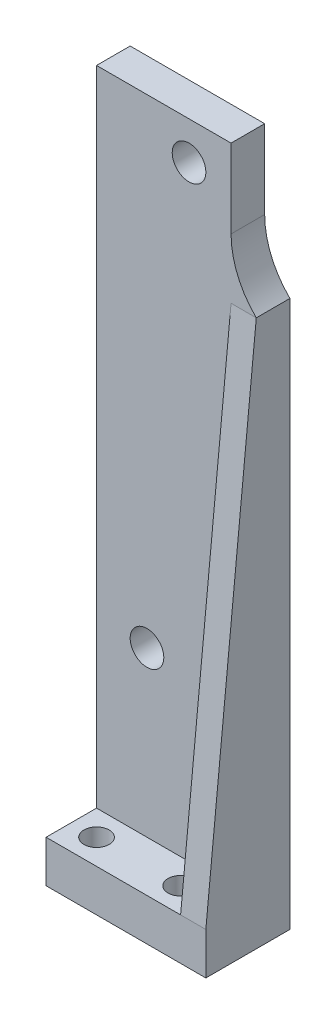
ISO-10303-21;
HEADER;
FILE_DESCRIPTION(('STEP AP214'),'2;1');
FILE_NAME('part.step','',(''),(''),'','','');
FILE_SCHEMA(('AUTOMOTIVE_DESIGN { 1 0 10303 214 1 1 1 1 }'));
ENDSEC;
DATA;
#1=APPLICATION_CONTEXT('core data for automotive mechanical design processes');
#2=APPLICATION_PROTOCOL_DEFINITION('international standard','automotive_design',2000,#1);
#3=PRODUCT_CONTEXT('',#1,'mechanical');
#4=PRODUCT('Part','Part','',(#3));
#5=PRODUCT_RELATED_PRODUCT_CATEGORY('part','',(#4));
#6=PRODUCT_DEFINITION_FORMATION('','',#4);
#7=PRODUCT_DEFINITION_CONTEXT('part definition',#1,'design');
#8=PRODUCT_DEFINITION('design','',#6,#7);
#9=PRODUCT_DEFINITION_SHAPE('','',#8);
#10=(LENGTH_UNIT() NAMED_UNIT(*) SI_UNIT(.MILLI.,.METRE.));
#11=(NAMED_UNIT(*) PLANE_ANGLE_UNIT() SI_UNIT($,.RADIAN.));
#12=(NAMED_UNIT(*) SI_UNIT($,.STERADIAN.) SOLID_ANGLE_UNIT());
#13=UNCERTAINTY_MEASURE_WITH_UNIT(LENGTH_MEASURE(1.E-05),#10,'distance_accuracy_value','');
#14=(GEOMETRIC_REPRESENTATION_CONTEXT(3) GLOBAL_UNCERTAINTY_ASSIGNED_CONTEXT((#13)) GLOBAL_UNIT_ASSIGNED_CONTEXT((#10,
#11,#12)) REPRESENTATION_CONTEXT('',''));
#15=CARTESIAN_POINT('',(0.,0.,0.));
#16=DIRECTION('',(0.,0.,1.));
#17=DIRECTION('',(1.,0.,0.));
#18=AXIS2_PLACEMENT_3D('',#15,#16,#17);
#19=CARTESIAN_POINT('',(1.00000000000001,77.,3.));
#20=DIRECTION('',(0.,0.,-1.));
#21=DIRECTION('',(-1.,0.,0.));
#22=AXIS2_PLACEMENT_3D('',#19,#20,#21);
#23=CYLINDRICAL_SURFACE('',#22,2.);
#24=CARTESIAN_POINT('',(1.00000000000001,77.,-3.));
#25=DIRECTION('',(0.,0.,1.));
#26=DIRECTION('',(1.,0.,0.));
#27=AXIS2_PLACEMENT_3D('',#24,#25,#26);
#28=CIRCLE('',#27,2.);
#29=CARTESIAN_POINT('',(3.00000000000001,77.,-3.));
#30=VERTEX_POINT('',#29);
#31=EDGE_CURVE('E242',#30,#30,#28,.T.);
#32=ORIENTED_EDGE('',*,*,#31,.T.);
#33=EDGE_LOOP('',(#32));
#34=FACE_BOUND('',#33,.T.);
#35=CARTESIAN_POINT('',(1.00000000000001,77.,-6.));
#36=DIRECTION('',(0.,0.,-1.));
#37=DIRECTION('',(-1.,0.,0.));
#38=AXIS2_PLACEMENT_3D('',#35,#36,#37);
#39=CIRCLE('',#38,2.);
#40=CARTESIAN_POINT('',(-0.999999999999993,77.,-6.));
#41=VERTEX_POINT('',#40);
#42=EDGE_CURVE('E163',#41,#41,#39,.F.);
#43=ORIENTED_EDGE('',*,*,#42,.F.);
#44=EDGE_LOOP('',(#43));
#45=FACE_BOUND('',#44,.T.);
#46=ADVANCED_FACE('F43',(#34,#45),#23,.F.);
#47=CARTESIAN_POINT('',(0.,5.,3.));
#48=DIRECTION('',(0.,0.,-1.));
#49=DIRECTION('',(-1.,0.,0.));
#50=AXIS2_PLACEMENT_3D('',#47,#48,#49);
#51=PLANE('',#50);
#52=DIRECTION('',(1.,0.,0.));
#53=VECTOR('',#52,1.);
#54=CARTESIAN_POINT('',(0.,0.,3.));
#55=LINE('',#54,#53);
#56=CARTESIAN_POINT('',(-10.,0.,3.));
#57=VERTEX_POINT('',#56);
#58=CARTESIAN_POINT('',(9.,0.,3.));
#59=VERTEX_POINT('',#58);
#60=EDGE_CURVE('E234',#57,#59,#55,.T.);
#61=ORIENTED_EDGE('',*,*,#60,.T.);
#62=DIRECTION('',(0.,-1.,0.));
#63=VECTOR('',#62,1.);
#64=CARTESIAN_POINT('',(9.,5.,3.));
#65=LINE('',#64,#63);
#66=CARTESIAN_POINT('',(9.,5.,3.));
#67=VERTEX_POINT('',#66);
#68=EDGE_CURVE('E135',#67,#59,#65,.T.);
#69=ORIENTED_EDGE('',*,*,#68,.F.);
#70=DIRECTION('',(-1.,0.,0.));
#71=VECTOR('',#70,1.);
#72=CARTESIAN_POINT('',(9.,5.,3.));
#73=LINE('',#72,#71);
#74=CARTESIAN_POINT('',(6.,5.,3.));
#75=VERTEX_POINT('',#74);
#76=EDGE_CURVE('E132',#67,#75,#73,.T.);
#77=ORIENTED_EDGE('',*,*,#76,.T.);
#78=DIRECTION('',(1.,0.,0.));
#79=VECTOR('',#78,1.);
#80=CARTESIAN_POINT('',(0.,5.,3.));
#81=LINE('',#80,#79);
#82=CARTESIAN_POINT('',(-10.,5.,3.));
#83=VERTEX_POINT('',#82);
#84=EDGE_CURVE('E213',#83,#75,#81,.T.);
#85=ORIENTED_EDGE('',*,*,#84,.F.);
#86=DIRECTION('',(0.,-1.,0.));
#87=VECTOR('',#86,1.);
#88=CARTESIAN_POINT('',(-10.,5.,3.));
#89=LINE('',#88,#87);
#90=EDGE_CURVE('E226',#83,#57,#89,.T.);
#91=ORIENTED_EDGE('',*,*,#90,.T.);
#92=EDGE_LOOP('',(#61,#69,#77,#85,#91));
#93=FACE_BOUND('',#92,.T.);
#94=ADVANCED_FACE('F278',(#93),#51,.F.);
#95=CARTESIAN_POINT('',(6.,5.,0.));
#96=DIRECTION('',(1.,0.,0.));
#97=DIRECTION('',(0.,0.,-1.));
#98=AXIS2_PLACEMENT_3D('',#95,#96,#97);
#99=PLANE('',#98);
#100=DIRECTION('',(0.,1.,0.));
#101=VECTOR('',#100,1.);
#102=CARTESIAN_POINT('',(6.,0.,-3.));
#103=LINE('',#102,#101);
#104=CARTESIAN_POINT('',(6.,72.1414284285429,-3.));
#105=VERTEX_POINT('',#104);
#106=CARTESIAN_POINT('',(6.,81.5,-3.));
#107=VERTEX_POINT('',#106);
#108=EDGE_CURVE('E191',#105,#107,#103,.T.);
#109=ORIENTED_EDGE('',*,*,#108,.F.);
#110=DIRECTION('',(0.,0.,-1.));
#111=VECTOR('',#110,1.);
#112=CARTESIAN_POINT('',(6.,72.1414284285429,-7.));
#113=LINE('',#112,#111);
#114=CARTESIAN_POINT('',(6.,72.1414284285429,-7.));
#115=VERTEX_POINT('',#114);
#116=EDGE_CURVE('E118',#105,#115,#113,.T.);
#117=ORIENTED_EDGE('',*,*,#116,.T.);
#118=DIRECTION('',(0.,1.,0.));
#119=VECTOR('',#118,1.);
#120=CARTESIAN_POINT('',(6.,0.,-7.));
#121=LINE('',#120,#119);
#122=CARTESIAN_POINT('',(6.,81.5,-7.));
#123=VERTEX_POINT('',#122);
#124=EDGE_CURVE('E175',#115,#123,#121,.T.);
#125=ORIENTED_EDGE('',*,*,#124,.T.);
#126=DIRECTION('',(0.,0.,1.));
#127=VECTOR('',#126,1.);
#128=CARTESIAN_POINT('',(6.,81.5,-7.));
#129=LINE('',#128,#127);
#130=EDGE_CURVE('E187',#123,#107,#129,.T.);
#131=ORIENTED_EDGE('',*,*,#130,.T.);
#132=EDGE_LOOP('',(#109,#117,#125,#131));
#133=FACE_BOUND('',#132,.T.);
#134=ADVANCED_FACE('F263',(#133),#99,.T.);
#135=CARTESIAN_POINT('',(-7.,5.,0.));
#136=DIRECTION('',(0.,-1.,0.));
#137=DIRECTION('',(0.,0.,-1.));
#138=AXIS2_PLACEMENT_3D('',#135,#136,#137);
#139=CYLINDRICAL_SURFACE('',#138,1.5);
#140=CARTESIAN_POINT('',(-7.,5.,0.));
#141=DIRECTION('',(0.,1.,0.));
#142=DIRECTION('',(0.,0.,1.));
#143=AXIS2_PLACEMENT_3D('',#140,#141,#142);
#144=CIRCLE('',#143,1.5);
#145=CARTESIAN_POINT('',(-7.,5.,1.5));
#146=VERTEX_POINT('',#145);
#147=EDGE_CURVE('E208',#146,#146,#144,.T.);
#148=ORIENTED_EDGE('',*,*,#147,.T.);
#149=EDGE_LOOP('',(#148));
#150=FACE_BOUND('',#149,.T.);
#151=CARTESIAN_POINT('',(-7.,0.,0.));
#152=DIRECTION('',(0.,1.,0.));
#153=DIRECTION('',(0.,0.,1.));
#154=AXIS2_PLACEMENT_3D('',#151,#152,#153);
#155=CIRCLE('',#154,1.5);
#156=CARTESIAN_POINT('',(-7.,0.,1.5));
#157=VERTEX_POINT('',#156);
#158=EDGE_CURVE('E230',#157,#157,#155,.T.);
#159=ORIENTED_EDGE('',*,*,#158,.F.);
#160=EDGE_LOOP('',(#159));
#161=FACE_BOUND('',#160,.T.);
#162=ADVANCED_FACE('F393',(#150,#161),#139,.F.);
#163=CARTESIAN_POINT('',(3.,5.,0.));
#164=DIRECTION('',(0.,-1.,0.));
#165=DIRECTION('',(0.,0.,-1.));
#166=AXIS2_PLACEMENT_3D('',#163,#164,#165);
#167=CYLINDRICAL_SURFACE('',#166,1.5);
#168=CARTESIAN_POINT('',(3.,5.,0.));
#169=DIRECTION('',(0.,1.,0.));
#170=DIRECTION('',(0.,0.,1.));
#171=AXIS2_PLACEMENT_3D('',#168,#169,#170);
#172=CIRCLE('',#171,1.5);
#173=CARTESIAN_POINT('',(3.,5.,1.5));
#174=VERTEX_POINT('',#173);
#175=EDGE_CURVE('E204',#174,#174,#172,.T.);
#176=ORIENTED_EDGE('',*,*,#175,.T.);
#177=EDGE_LOOP('',(#176));
#178=FACE_BOUND('',#177,.T.);
#179=CARTESIAN_POINT('',(3.,0.,0.));
#180=DIRECTION('',(0.,1.,0.));
#181=DIRECTION('',(0.,0.,1.));
#182=AXIS2_PLACEMENT_3D('',#179,#180,#181);
#183=CIRCLE('',#182,1.5);
#184=CARTESIAN_POINT('',(3.,0.,1.5));
#185=VERTEX_POINT('',#184);
#186=EDGE_CURVE('E200',#185,#185,#183,.T.);
#187=ORIENTED_EDGE('',*,*,#186,.F.);
#188=EDGE_LOOP('',(#187));
#189=FACE_BOUND('',#188,.T.);
#190=ADVANCED_FACE('F462',(#178,#189),#167,.F.);
#191=CARTESIAN_POINT('',(-10.,5.,0.));
#192=DIRECTION('',(1.,0.,0.));
#193=DIRECTION('',(0.,0.,-1.));
#194=AXIS2_PLACEMENT_3D('',#191,#192,#193);
#195=PLANE('',#194);
#196=DIRECTION('',(0.,0.,1.));
#197=VECTOR('',#196,1.);
#198=CARTESIAN_POINT('',(-10.,0.,0.));
#199=LINE('',#198,#197);
#200=CARTESIAN_POINT('',(-10.,0.,-7.));
#201=VERTEX_POINT('',#200);
#202=EDGE_CURVE('E209',#201,#57,#199,.T.);
#203=ORIENTED_EDGE('',*,*,#202,.T.);
#204=ORIENTED_EDGE('',*,*,#90,.F.);
#205=DIRECTION('',(0.,0.,1.));
#206=VECTOR('',#205,1.);
#207=CARTESIAN_POINT('',(-10.,5.,0.));
#208=LINE('',#207,#206);
#209=CARTESIAN_POINT('',(-10.,5.,-3.));
#210=VERTEX_POINT('',#209);
#211=EDGE_CURVE('E223',#210,#83,#208,.T.);
#212=ORIENTED_EDGE('',*,*,#211,.F.);
#213=DIRECTION('',(0.,-1.,0.));
#214=VECTOR('',#213,1.);
#215=CARTESIAN_POINT('',(-9.99999999999999,81.5,-3.));
#216=LINE('',#215,#214);
#217=CARTESIAN_POINT('',(-9.99999999999999,81.5,-3.));
#218=VERTEX_POINT('',#217);
#219=EDGE_CURVE('E176',#218,#210,#216,.T.);
#220=ORIENTED_EDGE('',*,*,#219,.F.);
#221=DIRECTION('',(0.,0.,1.));
#222=VECTOR('',#221,1.);
#223=CARTESIAN_POINT('',(-9.99999999999999,81.5,-7.));
#224=LINE('',#223,#222);
#225=CARTESIAN_POINT('',(-9.99999999999999,81.5,-7.));
#226=VERTEX_POINT('',#225);
#227=EDGE_CURVE('E197',#226,#218,#224,.T.);
#228=ORIENTED_EDGE('',*,*,#227,.F.);
#229=DIRECTION('',(0.,-1.,0.));
#230=VECTOR('',#229,1.);
#231=CARTESIAN_POINT('',(-9.99999999999999,81.5,-7.));
#232=LINE('',#231,#230);
#233=EDGE_CURVE('E183',#226,#201,#232,.T.);
#234=ORIENTED_EDGE('',*,*,#233,.T.);
#235=EDGE_LOOP('',(#203,#204,#212,#220,#228,#234));
#236=FACE_BOUND('',#235,.T.);
#237=ADVANCED_FACE('F269',(#236),#195,.F.);
#238=CARTESIAN_POINT('',(0.,5.,0.));
#239=DIRECTION('',(0.,1.,0.));
#240=DIRECTION('',(0.,0.,1.));
#241=AXIS2_PLACEMENT_3D('',#238,#239,#240);
#242=PLANE('',#241);
#243=ORIENTED_EDGE('',*,*,#175,.F.);
#244=EDGE_LOOP('',(#243));
#245=FACE_BOUND('',#244,.T.);
#246=ORIENTED_EDGE('',*,*,#147,.F.);
#247=EDGE_LOOP('',(#246));
#248=FACE_BOUND('',#247,.T.);
#249=ORIENTED_EDGE('',*,*,#84,.T.);
#250=DIRECTION('',(0.,0.,1.));
#251=VECTOR('',#250,1.);
#252=CARTESIAN_POINT('',(6.,5.,0.));
#253=LINE('',#252,#251);
#254=CARTESIAN_POINT('',(6.,5.,-3.));
#255=VERTEX_POINT('',#254);
#256=EDGE_CURVE('E216',#255,#75,#253,.T.);
#257=ORIENTED_EDGE('',*,*,#256,.F.);
#258=DIRECTION('',(1.,0.,0.));
#259=VECTOR('',#258,1.);
#260=CARTESIAN_POINT('',(0.,5.,-3.));
#261=LINE('',#260,#259);
#262=EDGE_CURVE('E220',#210,#255,#261,.T.);
#263=ORIENTED_EDGE('',*,*,#262,.F.);
#264=ORIENTED_EDGE('',*,*,#211,.T.);
#265=EDGE_LOOP('',(#249,#257,#263,#264));
#266=FACE_BOUND('',#265,.T.);
#267=ADVANCED_FACE('F274',(#245,#248,#266),#242,.T.);
#268=CARTESIAN_POINT('',(0.,0.,0.));
#269=DIRECTION('',(0.,1.,0.));
#270=DIRECTION('',(0.,0.,1.));
#271=AXIS2_PLACEMENT_3D('',#268,#269,#270);
#272=PLANE('',#271);
#273=ORIENTED_EDGE('',*,*,#186,.T.);
#274=EDGE_LOOP('',(#273));
#275=FACE_BOUND('',#274,.T.);
#276=ORIENTED_EDGE('',*,*,#158,.T.);
#277=EDGE_LOOP('',(#276));
#278=FACE_BOUND('',#277,.T.);
#279=ORIENTED_EDGE('',*,*,#60,.F.);
#280=ORIENTED_EDGE('',*,*,#202,.F.);
#281=DIRECTION('',(1.,0.,0.));
#282=VECTOR('',#281,1.);
#283=CARTESIAN_POINT('',(-10.,0.,-7.));
#284=LINE('',#283,#282);
#285=CARTESIAN_POINT('',(9.,0.,-7.));
#286=VERTEX_POINT('',#285);
#287=EDGE_CURVE('E172',#201,#286,#284,.T.);
#288=ORIENTED_EDGE('',*,*,#287,.T.);
#289=DIRECTION('',(0.,0.,-1.));
#290=VECTOR('',#289,1.);
#291=CARTESIAN_POINT('',(9.,0.,3.));
#292=LINE('',#291,#290);
#293=EDGE_CURVE('E151',#59,#286,#292,.T.);
#294=ORIENTED_EDGE('',*,*,#293,.F.);
#295=EDGE_LOOP('',(#279,#280,#288,#294));
#296=FACE_BOUND('',#295,.T.);
#297=ADVANCED_FACE('F282',(#275,#278,#296),#272,.F.);
#298=CARTESIAN_POINT('',(6.,81.5,-7.));
#299=DIRECTION('',(0.,1.,0.));
#300=DIRECTION('',(0.,0.,1.));
#301=AXIS2_PLACEMENT_3D('',#298,#299,#300);
#302=PLANE('',#301);
#303=DIRECTION('',(-1.,0.,0.));
#304=VECTOR('',#303,1.);
#305=CARTESIAN_POINT('',(6.,81.5,-3.));
#306=LINE('',#305,#304);
#307=EDGE_CURVE('E190',#107,#218,#306,.T.);
#308=ORIENTED_EDGE('',*,*,#307,.F.);
#309=ORIENTED_EDGE('',*,*,#130,.F.);
#310=DIRECTION('',(-1.,0.,0.));
#311=VECTOR('',#310,1.);
#312=CARTESIAN_POINT('',(6.,81.5,-7.));
#313=LINE('',#312,#311);
#314=EDGE_CURVE('E179',#123,#226,#313,.T.);
#315=ORIENTED_EDGE('',*,*,#314,.T.);
#316=ORIENTED_EDGE('',*,*,#227,.T.);
#317=EDGE_LOOP('',(#308,#309,#315,#316));
#318=FACE_BOUND('',#317,.T.);
#319=ADVANCED_FACE('F266',(#318),#302,.T.);
#320=CARTESIAN_POINT('',(0.,0.,-7.));
#321=DIRECTION('',(0.,0.,1.));
#322=DIRECTION('',(1.,0.,0.));
#323=AXIS2_PLACEMENT_3D('',#320,#321,#322);
#324=PLANE('',#323);
#325=CARTESIAN_POINT('',(1.00000000000001,77.,-7.));
#326=DIRECTION('',(0.,0.,-1.));
#327=DIRECTION('',(-1.,0.,0.));
#328=AXIS2_PLACEMENT_3D('',#325,#326,#327);
#329=CIRCLE('',#328,3.5);
#330=CARTESIAN_POINT('',(-2.49999999999999,77.,-7.));
#331=VERTEX_POINT('',#330);
#332=EDGE_CURVE('E158',#331,#331,#329,.T.);
#333=ORIENTED_EDGE('',*,*,#332,.F.);
#334=EDGE_LOOP('',(#333));
#335=FACE_BOUND('',#334,.T.);
#336=CARTESIAN_POINT('',(-3.99999999999999,24.5,-7.));
#337=DIRECTION('',(0.,0.,-1.));
#338=DIRECTION('',(-1.,0.,0.));
#339=AXIS2_PLACEMENT_3D('',#336,#337,#338);
#340=CIRCLE('',#339,2.);
#341=CARTESIAN_POINT('',(-5.99999999999999,24.5,-7.));
#342=VERTEX_POINT('',#341);
#343=EDGE_CURVE('E167',#342,#342,#340,.T.);
#344=ORIENTED_EDGE('',*,*,#343,.F.);
#345=EDGE_LOOP('',(#344));
#346=FACE_BOUND('',#345,.T.);
#347=ORIENTED_EDGE('',*,*,#287,.F.);
#348=ORIENTED_EDGE('',*,*,#233,.F.);
#349=ORIENTED_EDGE('',*,*,#314,.F.);
#350=ORIENTED_EDGE('',*,*,#124,.F.);
#351=CARTESIAN_POINT('',(16.,72.1414284285429,-7.));
#352=DIRECTION('',(0.,0.,1.));
#353=DIRECTION('',(1.,0.,0.));
#354=AXIS2_PLACEMENT_3D('',#351,#352,#353);
#355=CIRCLE('',#354,10.);
#356=CARTESIAN_POINT('',(9.,65.,-7.));
#357=VERTEX_POINT('',#356);
#358=EDGE_CURVE('E53',#115,#357,#355,.T.);
#359=ORIENTED_EDGE('',*,*,#358,.T.);
#360=DIRECTION('',(0.,1.,0.));
#361=VECTOR('',#360,1.);
#362=CARTESIAN_POINT('',(9.,0.,-7.));
#363=LINE('',#362,#361);
#364=EDGE_CURVE('E141',#286,#357,#363,.T.);
#365=ORIENTED_EDGE('',*,*,#364,.F.);
#366=EDGE_LOOP('',(#347,#348,#349,#350,#359,#365));
#367=FACE_BOUND('',#366,.T.);
#368=ADVANCED_FACE('F258',(#335,#346,#367),#324,.F.);
#369=CARTESIAN_POINT('',(0.,0.,-3.));
#370=DIRECTION('',(0.,0.,1.));
#371=DIRECTION('',(1.,0.,0.));
#372=AXIS2_PLACEMENT_3D('',#369,#370,#371);
#373=PLANE('',#372);
#374=CARTESIAN_POINT('',(-3.99999999999999,24.5,-3.));
#375=DIRECTION('',(0.,0.,1.));
#376=DIRECTION('',(1.,0.,0.));
#377=AXIS2_PLACEMENT_3D('',#374,#375,#376);
#378=CIRCLE('',#377,2.);
#379=CARTESIAN_POINT('',(-1.99999999999999,24.5,-3.));
#380=VERTEX_POINT('',#379);
#381=EDGE_CURVE('E171',#380,#380,#378,.T.);
#382=ORIENTED_EDGE('',*,*,#381,.F.);
#383=EDGE_LOOP('',(#382));
#384=FACE_BOUND('',#383,.T.);
#385=ORIENTED_EDGE('',*,*,#31,.F.);
#386=EDGE_LOOP('',(#385));
#387=FACE_BOUND('',#386,.T.);
#388=ORIENTED_EDGE('',*,*,#219,.T.);
#389=ORIENTED_EDGE('',*,*,#262,.T.);
#390=CARTESIAN_POINT('',(6.,65.,-3.));
#391=VERTEX_POINT('',#390);
#392=EDGE_CURVE('E126',#255,#391,#103,.T.);
#393=ORIENTED_EDGE('',*,*,#392,.T.);
#394=DIRECTION('',(1.,0.,0.));
#395=VECTOR('',#394,1.);
#396=CARTESIAN_POINT('',(0.,65.,-3.));
#397=LINE('',#396,#395);
#398=CARTESIAN_POINT('',(9.,65.,-3.));
#399=VERTEX_POINT('',#398);
#400=EDGE_CURVE('E11',#391,#399,#397,.T.);
#401=ORIENTED_EDGE('',*,*,#400,.T.);
#402=CARTESIAN_POINT('',(16.,72.1414284285429,-3.));
#403=DIRECTION('',(0.,0.,1.));
#404=DIRECTION('',(1.,0.,0.));
#405=AXIS2_PLACEMENT_3D('',#402,#403,#404);
#406=CIRCLE('',#405,10.);
#407=EDGE_CURVE('E59',#399,#105,#406,.F.);
#408=ORIENTED_EDGE('',*,*,#407,.T.);
#409=ORIENTED_EDGE('',*,*,#108,.T.);
#410=ORIENTED_EDGE('',*,*,#307,.T.);
#411=EDGE_LOOP('',(#388,#389,#393,#401,#408,#409,#410));
#412=FACE_BOUND('',#411,.T.);
#413=ADVANCED_FACE('F123',(#384,#387,#412),#373,.T.);
#414=CARTESIAN_POINT('',(-3.99999999999999,24.5,3.));
#415=DIRECTION('',(0.,0.,-1.));
#416=DIRECTION('',(-1.,0.,0.));
#417=AXIS2_PLACEMENT_3D('',#414,#415,#416);
#418=CYLINDRICAL_SURFACE('',#417,2.);
#419=ORIENTED_EDGE('',*,*,#381,.T.);
#420=EDGE_LOOP('',(#419));
#421=FACE_BOUND('',#420,.T.);
#422=ORIENTED_EDGE('',*,*,#343,.T.);
#423=EDGE_LOOP('',(#422));
#424=FACE_BOUND('',#423,.T.);
#425=ADVANCED_FACE('F305',(#421,#424),#418,.F.);
#426=CARTESIAN_POINT('',(1.00000000000001,77.,-6.));
#427=DIRECTION('',(0.,0.,-1.));
#428=DIRECTION('',(-1.,0.,0.));
#429=AXIS2_PLACEMENT_3D('',#426,#427,#428);
#430=PLANE('',#429);
#431=CARTESIAN_POINT('',(1.00000000000001,77.,-6.));
#432=DIRECTION('',(0.,0.,-1.));
#433=DIRECTION('',(-1.,0.,0.));
#434=AXIS2_PLACEMENT_3D('',#431,#432,#433);
#435=CIRCLE('',#434,3.5);
#436=CARTESIAN_POINT('',(-2.49999999999999,77.,-6.));
#437=VERTEX_POINT('',#436);
#438=EDGE_CURVE('E159',#437,#437,#435,.T.);
#439=ORIENTED_EDGE('',*,*,#438,.T.);
#440=EDGE_LOOP('',(#439));
#441=FACE_BOUND('',#440,.T.);
#442=ORIENTED_EDGE('',*,*,#42,.T.);
#443=EDGE_LOOP('',(#442));
#444=FACE_BOUND('',#443,.T.);
#445=ADVANCED_FACE('F315',(#441,#444),#430,.T.);
#446=CARTESIAN_POINT('',(1.00000000000001,77.,-6.));
#447=DIRECTION('',(0.,0.,-1.));
#448=DIRECTION('',(-1.,0.,0.));
#449=AXIS2_PLACEMENT_3D('',#446,#447,#448);
#450=CYLINDRICAL_SURFACE('',#449,3.5);
#451=ORIENTED_EDGE('',*,*,#438,.F.);
#452=EDGE_LOOP('',(#451));
#453=FACE_BOUND('',#452,.T.);
#454=ORIENTED_EDGE('',*,*,#332,.T.);
#455=EDGE_LOOP('',(#454));
#456=FACE_BOUND('',#455,.T.);
#457=ADVANCED_FACE('F326',(#453,#456),#450,.F.);
#458=CARTESIAN_POINT('',(9.,65.,-3.));
#459=DIRECTION('',(0.,-0.0995037190209989,-0.995037190209989));
#460=DIRECTION('',(0.,0.995037190209989,-0.0995037190209989));
#461=AXIS2_PLACEMENT_3D('',#458,#459,#460);
#462=PLANE('',#461);
#463=DIRECTION('',(0.,-0.995037190209989,0.0995037190209989));
#464=VECTOR('',#463,1.);
#465=CARTESIAN_POINT('',(6.,65.,-3.));
#466=LINE('',#465,#464);
#467=EDGE_CURVE('E143',#391,#75,#466,.T.);
#468=ORIENTED_EDGE('',*,*,#467,.T.);
#469=ORIENTED_EDGE('',*,*,#76,.F.);
#470=DIRECTION('',(0.,-0.995037190209989,0.0995037190209989));
#471=VECTOR('',#470,1.);
#472=CARTESIAN_POINT('',(9.,65.,-3.));
#473=LINE('',#472,#471);
#474=EDGE_CURVE('E111',#399,#67,#473,.T.);
#475=ORIENTED_EDGE('',*,*,#474,.F.);
#476=ORIENTED_EDGE('',*,*,#400,.F.);
#477=EDGE_LOOP('',(#468,#469,#475,#476));
#478=FACE_BOUND('',#477,.T.);
#479=ADVANCED_FACE('F130',(#478),#462,.F.);
#480=CARTESIAN_POINT('',(9.,0.,0.));
#481=DIRECTION('',(1.,0.,0.));
#482=DIRECTION('',(0.,0.,-1.));
#483=AXIS2_PLACEMENT_3D('',#480,#481,#482);
#484=PLANE('',#483);
#485=DIRECTION('',(0.,0.,1.));
#486=VECTOR('',#485,1.);
#487=CARTESIAN_POINT('',(9.,65.,-7.));
#488=LINE('',#487,#486);
#489=EDGE_CURVE('E117',#357,#399,#488,.T.);
#490=ORIENTED_EDGE('',*,*,#489,.T.);
#491=ORIENTED_EDGE('',*,*,#474,.T.);
#492=ORIENTED_EDGE('',*,*,#68,.T.);
#493=ORIENTED_EDGE('',*,*,#293,.T.);
#494=ORIENTED_EDGE('',*,*,#364,.T.);
#495=EDGE_LOOP('',(#490,#491,#492,#493,#494));
#496=FACE_BOUND('',#495,.T.);
#497=ADVANCED_FACE('F138',(#496),#484,.T.);
#498=CARTESIAN_POINT('',(6.,0.,0.));
#499=DIRECTION('',(1.,0.,0.));
#500=DIRECTION('',(0.,0.,-1.));
#501=AXIS2_PLACEMENT_3D('',#498,#499,#500);
#502=PLANE('',#501);
#503=ORIENTED_EDGE('',*,*,#392,.F.);
#504=ORIENTED_EDGE('',*,*,#256,.T.);
#505=ORIENTED_EDGE('',*,*,#467,.F.);
#506=EDGE_LOOP('',(#503,#504,#505));
#507=FACE_BOUND('',#506,.T.);
#508=ADVANCED_FACE('F276',(#507),#502,.F.);
#509=CARTESIAN_POINT('',(16.,72.1414284285429,-7.));
#510=DIRECTION('',(0.,0.,1.));
#511=DIRECTION('',(1.,0.,0.));
#512=AXIS2_PLACEMENT_3D('',#509,#510,#511);
#513=CYLINDRICAL_SURFACE('',#512,10.);
#514=ORIENTED_EDGE('',*,*,#358,.F.);
#515=ORIENTED_EDGE('',*,*,#116,.F.);
#516=ORIENTED_EDGE('',*,*,#407,.F.);
#517=ORIENTED_EDGE('',*,*,#489,.F.);
#518=EDGE_LOOP('',(#514,#515,#516,#517));
#519=FACE_BOUND('',#518,.T.);
#520=ADVANCED_FACE('F45',(#519),#513,.F.);
#521=CLOSED_SHELL('',(#46,#94,#134,#162,#190,#237,#267,#297,#319,#368,#413,#425,#445,#457,#479,
#497,#508,#520));
#522=MANIFOLD_SOLID_BREP('B2',#521);
#523=ADVANCED_BREP_SHAPE_REPRESENTATION('',(#18,#522),#14);
#524=SHAPE_DEFINITION_REPRESENTATION(#9,#523);
ENDSEC;
END-ISO-10303-21;
